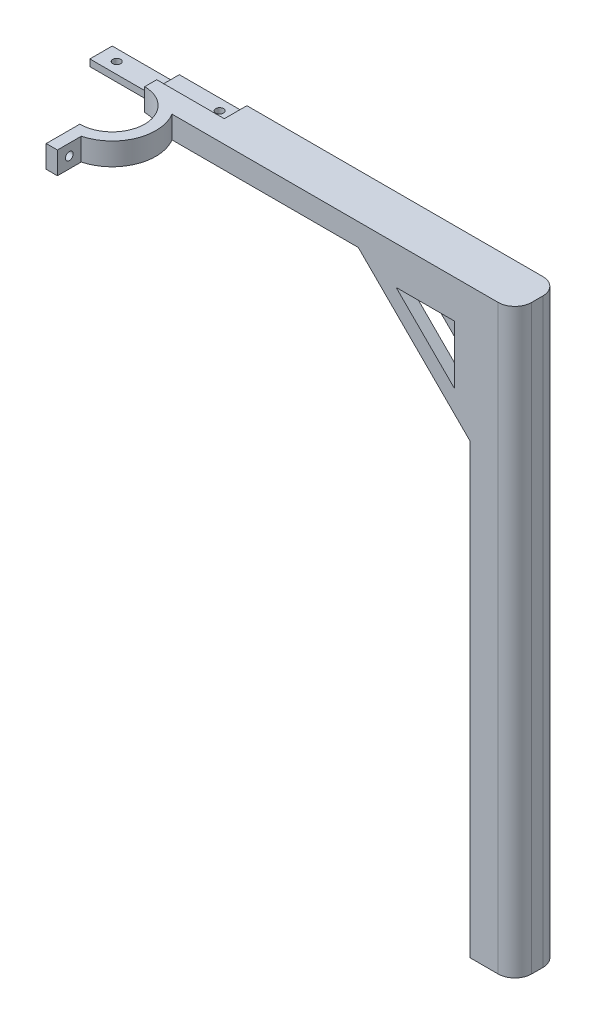
ISO-10303-21;
HEADER;
FILE_DESCRIPTION(('STEP AP214'),'2;1');
FILE_NAME('part.step','',(''),(''),'','','');
FILE_SCHEMA(('AUTOMOTIVE_DESIGN { 1 0 10303 214 1 1 1 1 }'));
ENDSEC;
DATA;
#1=APPLICATION_CONTEXT('core data for automotive mechanical design processes');
#2=APPLICATION_PROTOCOL_DEFINITION('international standard','automotive_design',2000,#1);
#3=PRODUCT_CONTEXT('',#1,'mechanical');
#4=PRODUCT('Part','Part','',(#3));
#5=PRODUCT_RELATED_PRODUCT_CATEGORY('part','',(#4));
#6=PRODUCT_DEFINITION_FORMATION('','',#4);
#7=PRODUCT_DEFINITION_CONTEXT('part definition',#1,'design');
#8=PRODUCT_DEFINITION('design','',#6,#7);
#9=PRODUCT_DEFINITION_SHAPE('','',#8);
#10=(LENGTH_UNIT() NAMED_UNIT(*) SI_UNIT(.MILLI.,.METRE.));
#11=(NAMED_UNIT(*) PLANE_ANGLE_UNIT() SI_UNIT($,.RADIAN.));
#12=(NAMED_UNIT(*) SI_UNIT($,.STERADIAN.) SOLID_ANGLE_UNIT());
#13=UNCERTAINTY_MEASURE_WITH_UNIT(LENGTH_MEASURE(1.E-05),#10,'distance_accuracy_value','');
#14=(GEOMETRIC_REPRESENTATION_CONTEXT(3) GLOBAL_UNCERTAINTY_ASSIGNED_CONTEXT((#13)) GLOBAL_UNIT_ASSIGNED_CONTEXT((#10,
#11,#12)) REPRESENTATION_CONTEXT('',''));
#15=CARTESIAN_POINT('',(0.,0.,0.));
#16=DIRECTION('',(0.,0.,1.));
#17=DIRECTION('',(1.,0.,0.));
#18=AXIS2_PLACEMENT_3D('',#15,#16,#17);
#19=CARTESIAN_POINT('',(340.,260.,0.));
#20=DIRECTION('',(0.,-1.,0.));
#21=DIRECTION('',(0.,0.,-1.));
#22=AXIS2_PLACEMENT_3D('',#19,#20,#21);
#23=PLANE('',#22);
#24=DIRECTION('',(-1.,0.,0.));
#25=VECTOR('',#24,1.);
#26=CARTESIAN_POINT('',(200.2,260.,-9.9));
#27=LINE('',#26,#25);
#28=CARTESIAN_POINT('',(200.2,260.,-9.9));
#29=VERTEX_POINT('',#28);
#30=CARTESIAN_POINT('',(170.,260.,-9.9));
#31=VERTEX_POINT('',#30);
#32=EDGE_CURVE('E327',#29,#31,#27,.T.);
#33=ORIENTED_EDGE('',*,*,#32,.T.);
#34=DIRECTION('',(0.,0.,1.));
#35=VECTOR('',#34,1.);
#36=CARTESIAN_POINT('',(170.,260.,0.));
#37=LINE('',#36,#35);
#38=CARTESIAN_POINT('',(170.,260.,-4.5));
#39=VERTEX_POINT('',#38);
#40=EDGE_CURVE('E478',#31,#39,#37,.T.);
#41=ORIENTED_EDGE('',*,*,#40,.T.);
#42=CARTESIAN_POINT('',(170.,260.,10.));
#43=DIRECTION('',(0.,-1.,0.));
#44=DIRECTION('',(0.,0.,1.));
#45=AXIS2_PLACEMENT_3D('',#42,#43,#44);
#46=CIRCLE('',#45,14.5);
#47=CARTESIAN_POINT('',(170.,260.,24.5));
#48=VERTEX_POINT('',#47);
#49=EDGE_CURVE('E458',#48,#39,#46,.F.);
#50=ORIENTED_EDGE('',*,*,#49,.F.);
#51=DIRECTION('',(0.,0.,1.));
#52=VECTOR('',#51,1.);
#53=CARTESIAN_POINT('',(170.,260.,0.));
#54=LINE('',#53,#52);
#55=CARTESIAN_POINT('',(170.,260.,39.5));
#56=VERTEX_POINT('',#55);
#57=EDGE_CURVE('E455',#48,#56,#54,.T.);
#58=ORIENTED_EDGE('',*,*,#57,.T.);
#59=DIRECTION('',(1.,0.,0.));
#60=VECTOR('',#59,1.);
#61=CARTESIAN_POINT('',(340.,260.,39.5));
#62=LINE('',#61,#60);
#63=CARTESIAN_POINT('',(175.,260.,39.5));
#64=VERTEX_POINT('',#63);
#65=EDGE_CURVE('E452',#56,#64,#62,.T.);
#66=ORIENTED_EDGE('',*,*,#65,.T.);
#67=DIRECTION('',(0.,0.,1.));
#68=VECTOR('',#67,1.);
#69=CARTESIAN_POINT('',(175.,260.,0.));
#70=LINE('',#69,#68);
#71=CARTESIAN_POINT('',(175.,260.,28.8480768249708));
#72=VERTEX_POINT('',#71);
#73=EDGE_CURVE('E449',#72,#64,#70,.T.);
#74=ORIENTED_EDGE('',*,*,#73,.F.);
#75=CARTESIAN_POINT('',(170.,260.,10.));
#76=DIRECTION('',(0.,-1.,0.));
#77=DIRECTION('',(0.,0.,1.));
#78=AXIS2_PLACEMENT_3D('',#75,#76,#77);
#79=CIRCLE('',#78,19.5);
#80=CARTESIAN_POINT('',(186.740669042783,260.,0.));
#81=VERTEX_POINT('',#80);
#82=EDGE_CURVE('E430',#72,#81,#79,.F.);
#83=ORIENTED_EDGE('',*,*,#82,.T.);
#84=DIRECTION('',(-1.,0.,0.));
#85=VECTOR('',#84,1.);
#86=CARTESIAN_POINT('',(340.,260.,0.));
#87=LINE('',#86,#85);
#88=CARTESIAN_POINT('',(332.5,260.,0.));
#89=VERTEX_POINT('',#88);
#90=EDGE_CURVE('E490',#89,#81,#87,.T.);
#91=ORIENTED_EDGE('',*,*,#90,.F.);
#92=CARTESIAN_POINT('',(332.5,260.,-7.5));
#93=DIRECTION('',(0.,1.,0.));
#94=DIRECTION('',(0.,0.,-1.));
#95=AXIS2_PLACEMENT_3D('',#92,#93,#94);
#96=CIRCLE('',#95,7.5);
#97=CARTESIAN_POINT('',(340.,260.,-7.5));
#98=VERTEX_POINT('',#97);
#99=EDGE_CURVE('E85',#98,#89,#96,.F.);
#100=ORIENTED_EDGE('',*,*,#99,.F.);
#101=DIRECTION('',(0.,0.,1.));
#102=VECTOR('',#101,1.);
#103=CARTESIAN_POINT('',(340.,260.,0.));
#104=LINE('',#103,#102);
#105=CARTESIAN_POINT('',(340.,260.,-12.5));
#106=VERTEX_POINT('',#105);
#107=EDGE_CURVE('E487',#106,#98,#104,.T.);
#108=ORIENTED_EDGE('',*,*,#107,.F.);
#109=CARTESIAN_POINT('',(332.5,260.,-12.5));
#110=DIRECTION('',(0.,1.,0.));
#111=DIRECTION('',(0.,0.,-1.));
#112=AXIS2_PLACEMENT_3D('',#109,#110,#111);
#113=CIRCLE('',#112,7.5);
#114=CARTESIAN_POINT('',(332.5,260.,-20.));
#115=VERTEX_POINT('',#114);
#116=EDGE_CURVE('E524',#115,#106,#113,.F.);
#117=ORIENTED_EDGE('',*,*,#116,.F.);
#118=DIRECTION('',(1.,0.,0.));
#119=VECTOR('',#118,1.);
#120=CARTESIAN_POINT('',(340.,260.,-20.));
#121=LINE('',#120,#119);
#122=CARTESIAN_POINT('',(200.2,260.,-20.));
#123=VERTEX_POINT('',#122);
#124=EDGE_CURVE('E99',#123,#115,#121,.T.);
#125=ORIENTED_EDGE('',*,*,#124,.F.);
#126=DIRECTION('',(0.,0.,1.));
#127=VECTOR('',#126,1.);
#128=CARTESIAN_POINT('',(200.2,260.,-20.));
#129=LINE('',#128,#127);
#130=EDGE_CURVE('E92',#123,#29,#129,.T.);
#131=ORIENTED_EDGE('',*,*,#130,.T.);
#132=EDGE_LOOP('',(#33,#41,#50,#58,#66,#74,#83,#91,#100,#108,#117,#125,#131));
#133=FACE_BOUND('',#132,.T.);
#134=ADVANCED_FACE('F76',(#133),#23,.F.);
#135=CARTESIAN_POINT('',(170.,0.,0.));
#136=DIRECTION('',(-1.,0.,0.));
#137=DIRECTION('',(0.,0.,-1.));
#138=AXIS2_PLACEMENT_3D('',#135,#136,#137);
#139=PLANE('',#138);
#140=DIRECTION('',(0.,-1.,0.));
#141=VECTOR('',#140,1.);
#142=CARTESIAN_POINT('',(170.,250.,-10.));
#143=LINE('',#142,#141);
#144=CARTESIAN_POINT('',(170.,253.,-10.));
#145=VERTEX_POINT('',#144);
#146=CARTESIAN_POINT('',(170.,250.,-10.));
#147=VERTEX_POINT('',#146);
#148=EDGE_CURVE('E295',#145,#147,#143,.T.);
#149=ORIENTED_EDGE('',*,*,#148,.T.);
#150=DIRECTION('',(0.,0.,-1.));
#151=VECTOR('',#150,1.);
#152=CARTESIAN_POINT('',(170.,250.,0.));
#153=LINE('',#152,#151);
#154=CARTESIAN_POINT('',(170.,250.,-4.5));
#155=VERTEX_POINT('',#154);
#156=EDGE_CURVE('E473',#155,#147,#153,.T.);
#157=ORIENTED_EDGE('',*,*,#156,.F.);
#158=DIRECTION('',(0.,1.,0.));
#159=VECTOR('',#158,1.);
#160=CARTESIAN_POINT('',(170.,0.,-4.5));
#161=LINE('',#160,#159);
#162=EDGE_CURVE('E510',#39,#155,#161,.F.);
#163=ORIENTED_EDGE('',*,*,#162,.F.);
#164=ORIENTED_EDGE('',*,*,#40,.F.);
#165=DIRECTION('',(0.,-1.,0.));
#166=VECTOR('',#165,1.);
#167=CARTESIAN_POINT('',(170.,260.,-9.9));
#168=LINE('',#167,#166);
#169=CARTESIAN_POINT('',(170.,256.9,-9.9));
#170=VERTEX_POINT('',#169);
#171=EDGE_CURVE('E308',#31,#170,#168,.T.);
#172=ORIENTED_EDGE('',*,*,#171,.T.);
#173=DIRECTION('',(0.,0.,-1.));
#174=VECTOR('',#173,1.);
#175=CARTESIAN_POINT('',(170.,256.9,-20.));
#176=LINE('',#175,#174);
#177=CARTESIAN_POINT('',(170.,256.9,-20.));
#178=VERTEX_POINT('',#177);
#179=EDGE_CURVE('E312',#170,#178,#176,.T.);
#180=ORIENTED_EDGE('',*,*,#179,.T.);
#181=DIRECTION('',(0.,1.,0.));
#182=VECTOR('',#181,1.);
#183=CARTESIAN_POINT('',(170.,260.,-20.));
#184=LINE('',#183,#182);
#185=CARTESIAN_POINT('',(170.,253.,-20.));
#186=VERTEX_POINT('',#185);
#187=EDGE_CURVE('E476',#186,#178,#184,.T.);
#188=ORIENTED_EDGE('',*,*,#187,.F.);
#189=DIRECTION('',(0.,0.,1.));
#190=VECTOR('',#189,1.);
#191=CARTESIAN_POINT('',(170.,253.,-20.));
#192=LINE('',#191,#190);
#193=EDGE_CURVE('E275',#186,#145,#192,.T.);
#194=ORIENTED_EDGE('',*,*,#193,.T.);
#195=EDGE_LOOP('',(#149,#157,#163,#164,#172,#180,#188,#194));
#196=FACE_BOUND('',#195,.T.);
#197=ADVANCED_FACE('F568',(#196),#139,.T.);
#198=CARTESIAN_POINT('',(340.,260.,-20.));
#199=DIRECTION('',(0.,0.,1.));
#200=DIRECTION('',(-1.,0.,0.));
#201=AXIS2_PLACEMENT_3D('',#198,#199,#200);
#202=PLANE('',#201);
#203=DIRECTION('',(-1.,0.,0.));
#204=VECTOR('',#203,1.);
#205=CARTESIAN_POINT('',(340.,243.,-20.));
#206=LINE('',#205,#204);
#207=CARTESIAN_POINT('',(313.,243.,-20.));
#208=VERTEX_POINT('',#207);
#209=CARTESIAN_POINT('',(286.899494936612,243.,-20.));
#210=VERTEX_POINT('',#209);
#211=EDGE_CURVE('E346',#208,#210,#206,.T.);
#212=ORIENTED_EDGE('',*,*,#211,.T.);
#213=DIRECTION('',(0.707106781186548,-0.707106781186547,0.));
#214=VECTOR('',#213,1.);
#215=CARTESIAN_POINT('',(434.949747468306,94.9497474683059,-20.));
#216=LINE('',#215,#214);
#217=CARTESIAN_POINT('',(313.,216.899494936612,-20.));
#218=VERTEX_POINT('',#217);
#219=EDGE_CURVE('E362',#210,#218,#216,.T.);
#220=ORIENTED_EDGE('',*,*,#219,.T.);
#221=DIRECTION('',(0.,1.,0.));
#222=VECTOR('',#221,1.);
#223=CARTESIAN_POINT('',(313.,0.,-20.));
#224=LINE('',#223,#222);
#225=EDGE_CURVE('E353',#218,#208,#224,.T.);
#226=ORIENTED_EDGE('',*,*,#225,.T.);
#227=EDGE_LOOP('',(#212,#220,#226));
#228=FACE_BOUND('',#227,.T.);
#229=DIRECTION('',(-1.,0.,0.));
#230=VECTOR('',#229,1.);
#231=CARTESIAN_POINT('',(200.2,256.9,-20.));
#232=LINE('',#231,#230);
#233=CARTESIAN_POINT('',(200.2,256.9,-20.));
#234=VERTEX_POINT('',#233);
#235=EDGE_CURVE('E318',#234,#178,#232,.T.);
#236=ORIENTED_EDGE('',*,*,#235,.F.);
#237=DIRECTION('',(0.,1.,0.));
#238=VECTOR('',#237,1.);
#239=CARTESIAN_POINT('',(200.2,260.,-20.));
#240=LINE('',#239,#238);
#241=EDGE_CURVE('E310',#234,#123,#240,.T.);
#242=ORIENTED_EDGE('',*,*,#241,.T.);
#243=ORIENTED_EDGE('',*,*,#124,.T.);
#244=DIRECTION('',(0.,-1.,0.));
#245=VECTOR('',#244,1.);
#246=CARTESIAN_POINT('',(332.5,260.,-20.));
#247=LINE('',#246,#245);
#248=CARTESIAN_POINT('',(332.5,0.,-20.));
#249=VERTEX_POINT('',#248);
#250=EDGE_CURVE('E12',#249,#115,#247,.F.);
#251=ORIENTED_EDGE('',*,*,#250,.F.);
#252=DIRECTION('',(1.,0.,0.));
#253=VECTOR('',#252,1.);
#254=CARTESIAN_POINT('',(340.,0.,-20.));
#255=LINE('',#254,#253);
#256=CARTESIAN_POINT('',(320.,0.,-20.));
#257=VERTEX_POINT('',#256);
#258=EDGE_CURVE('E491',#257,#249,#255,.T.);
#259=ORIENTED_EDGE('',*,*,#258,.F.);
#260=DIRECTION('',(0.,-1.,0.));
#261=VECTOR('',#260,1.);
#262=CARTESIAN_POINT('',(320.,260.,-20.));
#263=LINE('',#262,#261);
#264=CARTESIAN_POINT('',(320.,200.,-20.));
#265=VERTEX_POINT('',#264);
#266=EDGE_CURVE('E495',#265,#257,#263,.T.);
#267=ORIENTED_EDGE('',*,*,#266,.F.);
#268=DIRECTION('',(0.707106781186548,-0.707106781186547,0.));
#269=VECTOR('',#268,1.);
#270=CARTESIAN_POINT('',(270.,250.,-20.));
#271=LINE('',#270,#269);
#272=CARTESIAN_POINT('',(270.,250.,-20.));
#273=VERTEX_POINT('',#272);
#274=EDGE_CURVE('E369',#273,#265,#271,.T.);
#275=ORIENTED_EDGE('',*,*,#274,.F.);
#276=DIRECTION('',(1.,0.,0.));
#277=VECTOR('',#276,1.);
#278=CARTESIAN_POINT('',(170.,250.,-20.));
#279=LINE('',#278,#277);
#280=CARTESIAN_POINT('',(140.,250.,-20.));
#281=VERTEX_POINT('',#280);
#282=EDGE_CURVE('E294',#281,#273,#279,.T.);
#283=ORIENTED_EDGE('',*,*,#282,.F.);
#284=DIRECTION('',(0.,1.,0.));
#285=VECTOR('',#284,1.);
#286=CARTESIAN_POINT('',(140.,250.,-20.));
#287=LINE('',#286,#285);
#288=CARTESIAN_POINT('',(140.,253.,-20.));
#289=VERTEX_POINT('',#288);
#290=EDGE_CURVE('E286',#281,#289,#287,.T.);
#291=ORIENTED_EDGE('',*,*,#290,.T.);
#292=DIRECTION('',(1.,0.,0.));
#293=VECTOR('',#292,1.);
#294=CARTESIAN_POINT('',(140.,253.,-20.));
#295=LINE('',#294,#293);
#296=EDGE_CURVE('E270',#289,#186,#295,.T.);
#297=ORIENTED_EDGE('',*,*,#296,.T.);
#298=ORIENTED_EDGE('',*,*,#187,.T.);
#299=EDGE_LOOP('',(#236,#242,#243,#251,#259,#267,#275,#283,#291,#297,#298));
#300=FACE_BOUND('',#299,.T.);
#301=ADVANCED_FACE('F292',(#228,#300),#202,.F.);
#302=CARTESIAN_POINT('',(170.,250.,0.));
#303=DIRECTION('',(0.,1.,0.));
#304=DIRECTION('',(0.,0.,1.));
#305=AXIS2_PLACEMENT_3D('',#302,#303,#304);
#306=PLANE('',#305);
#307=CARTESIAN_POINT('',(147.,250.,-15.));
#308=DIRECTION('',(0.,1.,0.));
#309=DIRECTION('',(0.,0.,1.));
#310=AXIS2_PLACEMENT_3D('',#307,#308,#309);
#311=CIRCLE('',#310,1.75000000000001);
#312=CARTESIAN_POINT('',(147.,250.,-13.25));
#313=VERTEX_POINT('',#312);
#314=EDGE_CURVE('E867',#313,#313,#311,.F.);
#315=ORIENTED_EDGE('',*,*,#314,.F.);
#316=EDGE_LOOP('',(#315));
#317=FACE_BOUND('',#316,.T.);
#318=CARTESIAN_POINT('',(193.,250.,-15.));
#319=DIRECTION('',(0.,1.,0.));
#320=DIRECTION('',(0.,0.,1.));
#321=AXIS2_PLACEMENT_3D('',#318,#319,#320);
#322=CIRCLE('',#321,1.75000000000001);
#323=CARTESIAN_POINT('',(193.,250.,-13.25));
#324=VERTEX_POINT('',#323);
#325=EDGE_CURVE('E300',#324,#324,#322,.T.);
#326=ORIENTED_EDGE('',*,*,#325,.T.);
#327=EDGE_LOOP('',(#326));
#328=FACE_BOUND('',#327,.T.);
#329=DIRECTION('',(-1.,0.,0.));
#330=VECTOR('',#329,1.);
#331=CARTESIAN_POINT('',(320.,250.,-15.));
#332=LINE('',#331,#330);
#333=CARTESIAN_POINT('',(320.,250.,-15.));
#334=VERTEX_POINT('',#333);
#335=CARTESIAN_POINT('',(270.,250.,-15.));
#336=VERTEX_POINT('',#335);
#337=EDGE_CURVE('E373',#334,#336,#332,.T.);
#338=ORIENTED_EDGE('',*,*,#337,.F.);
#339=DIRECTION('',(0.,0.,-1.));
#340=VECTOR('',#339,1.);
#341=CARTESIAN_POINT('',(320.,250.,0.));
#342=LINE('',#341,#340);
#343=CARTESIAN_POINT('',(320.,250.,-5.));
#344=VERTEX_POINT('',#343);
#345=EDGE_CURVE('E472',#344,#334,#342,.T.);
#346=ORIENTED_EDGE('',*,*,#345,.F.);
#347=DIRECTION('',(-1.,0.,0.));
#348=VECTOR('',#347,1.);
#349=CARTESIAN_POINT('',(320.,250.,-5.));
#350=LINE('',#349,#348);
#351=CARTESIAN_POINT('',(270.,250.,-5.));
#352=VERTEX_POINT('',#351);
#353=EDGE_CURVE('E412',#344,#352,#350,.T.);
#354=ORIENTED_EDGE('',*,*,#353,.T.);
#355=DIRECTION('',(0.,0.,1.));
#356=VECTOR('',#355,1.);
#357=CARTESIAN_POINT('',(270.,250.,-5.));
#358=LINE('',#357,#356);
#359=CARTESIAN_POINT('',(270.,250.,0.));
#360=VERTEX_POINT('',#359);
#361=EDGE_CURVE('E423',#352,#360,#358,.T.);
#362=ORIENTED_EDGE('',*,*,#361,.T.);
#363=DIRECTION('',(1.,0.,0.));
#364=VECTOR('',#363,1.);
#365=CARTESIAN_POINT('',(170.,250.,0.));
#366=LINE('',#365,#364);
#367=CARTESIAN_POINT('',(186.740669042783,250.,0.));
#368=VERTEX_POINT('',#367);
#369=EDGE_CURVE('E483',#368,#360,#366,.T.);
#370=ORIENTED_EDGE('',*,*,#369,.F.);
#371=CARTESIAN_POINT('',(170.,250.,10.));
#372=DIRECTION('',(0.,-1.,0.));
#373=DIRECTION('',(0.,0.,1.));
#374=AXIS2_PLACEMENT_3D('',#371,#372,#373);
#375=CIRCLE('',#374,19.5);
#376=CARTESIAN_POINT('',(175.,250.,28.8480768249708));
#377=VERTEX_POINT('',#376);
#378=EDGE_CURVE('E443',#368,#377,#375,.T.);
#379=ORIENTED_EDGE('',*,*,#378,.T.);
#380=DIRECTION('',(0.,0.,-1.));
#381=VECTOR('',#380,1.);
#382=CARTESIAN_POINT('',(175.,250.,0.));
#383=LINE('',#382,#381);
#384=CARTESIAN_POINT('',(175.,250.,39.5));
#385=VERTEX_POINT('',#384);
#386=EDGE_CURVE('E446',#385,#377,#383,.T.);
#387=ORIENTED_EDGE('',*,*,#386,.F.);
#388=DIRECTION('',(-1.,0.,0.));
#389=VECTOR('',#388,1.);
#390=CARTESIAN_POINT('',(340.,250.,39.5));
#391=LINE('',#390,#389);
#392=CARTESIAN_POINT('',(170.,250.,39.5));
#393=VERTEX_POINT('',#392);
#394=EDGE_CURVE('E433',#385,#393,#391,.T.);
#395=ORIENTED_EDGE('',*,*,#394,.T.);
#396=DIRECTION('',(0.,0.,-1.));
#397=VECTOR('',#396,1.);
#398=CARTESIAN_POINT('',(170.,250.,0.));
#399=LINE('',#398,#397);
#400=CARTESIAN_POINT('',(170.,250.,24.5));
#401=VERTEX_POINT('',#400);
#402=EDGE_CURVE('E436',#393,#401,#399,.T.);
#403=ORIENTED_EDGE('',*,*,#402,.T.);
#404=CARTESIAN_POINT('',(170.,250.,10.));
#405=DIRECTION('',(0.,-1.,0.));
#406=DIRECTION('',(0.,0.,1.));
#407=AXIS2_PLACEMENT_3D('',#404,#405,#406);
#408=CIRCLE('',#407,14.5);
#409=EDGE_CURVE('E440',#155,#401,#408,.T.);
#410=ORIENTED_EDGE('',*,*,#409,.F.);
#411=ORIENTED_EDGE('',*,*,#156,.T.);
#412=DIRECTION('',(1.,0.,0.));
#413=VECTOR('',#412,1.);
#414=CARTESIAN_POINT('',(140.,250.,-10.));
#415=LINE('',#414,#413);
#416=CARTESIAN_POINT('',(140.,250.,-10.));
#417=VERTEX_POINT('',#416);
#418=EDGE_CURVE('E306',#417,#147,#415,.T.);
#419=ORIENTED_EDGE('',*,*,#418,.F.);
#420=DIRECTION('',(0.,0.,-1.));
#421=VECTOR('',#420,1.);
#422=CARTESIAN_POINT('',(140.,250.,-20.));
#423=LINE('',#422,#421);
#424=EDGE_CURVE('E279',#417,#281,#423,.T.);
#425=ORIENTED_EDGE('',*,*,#424,.T.);
#426=ORIENTED_EDGE('',*,*,#282,.T.);
#427=DIRECTION('',(0.,0.,-1.));
#428=VECTOR('',#427,1.);
#429=CARTESIAN_POINT('',(270.,250.,-15.));
#430=LINE('',#429,#428);
#431=EDGE_CURVE('E380',#336,#273,#430,.T.);
#432=ORIENTED_EDGE('',*,*,#431,.F.);
#433=EDGE_LOOP('',(#338,#346,#354,#362,#370,#379,#387,#395,#403,#410,#411,#419,#425,#426,#432));
#434=FACE_BOUND('',#433,.T.);
#435=ADVANCED_FACE('F561',(#317,#328,#434),#306,.F.);
#436=CARTESIAN_POINT('',(320.,260.,0.));
#437=DIRECTION('',(1.,0.,0.));
#438=DIRECTION('',(0.,0.,1.));
#439=AXIS2_PLACEMENT_3D('',#436,#437,#438);
#440=PLANE('',#439);
#441=ORIENTED_EDGE('',*,*,#266,.T.);
#442=DIRECTION('',(0.,0.,-1.));
#443=VECTOR('',#442,1.);
#444=CARTESIAN_POINT('',(320.,0.,0.));
#445=LINE('',#444,#443);
#446=CARTESIAN_POINT('',(320.,0.,0.));
#447=VERTEX_POINT('',#446);
#448=EDGE_CURVE('E500',#447,#257,#445,.T.);
#449=ORIENTED_EDGE('',*,*,#448,.F.);
#450=DIRECTION('',(0.,-1.,0.));
#451=VECTOR('',#450,1.);
#452=CARTESIAN_POINT('',(320.,260.,0.));
#453=LINE('',#452,#451);
#454=CARTESIAN_POINT('',(320.,200.,0.));
#455=VERTEX_POINT('',#454);
#456=EDGE_CURVE('E507',#455,#447,#453,.T.);
#457=ORIENTED_EDGE('',*,*,#456,.F.);
#458=DIRECTION('',(0.,0.,1.));
#459=VECTOR('',#458,1.);
#460=CARTESIAN_POINT('',(320.,200.,-5.));
#461=LINE('',#460,#459);
#462=CARTESIAN_POINT('',(320.,200.,-5.));
#463=VERTEX_POINT('',#462);
#464=EDGE_CURVE('E419',#463,#455,#461,.T.);
#465=ORIENTED_EDGE('',*,*,#464,.F.);
#466=DIRECTION('',(0.,1.,0.));
#467=VECTOR('',#466,1.);
#468=CARTESIAN_POINT('',(320.,200.,-5.));
#469=LINE('',#468,#467);
#470=EDGE_CURVE('E417',#463,#344,#469,.T.);
#471=ORIENTED_EDGE('',*,*,#470,.T.);
#472=ORIENTED_EDGE('',*,*,#345,.T.);
#473=DIRECTION('',(0.,1.,0.));
#474=VECTOR('',#473,1.);
#475=CARTESIAN_POINT('',(320.,200.,-15.));
#476=LINE('',#475,#474);
#477=CARTESIAN_POINT('',(320.,200.,-15.));
#478=VERTEX_POINT('',#477);
#479=EDGE_CURVE('E376',#478,#334,#476,.T.);
#480=ORIENTED_EDGE('',*,*,#479,.F.);
#481=DIRECTION('',(0.,0.,-1.));
#482=VECTOR('',#481,1.);
#483=CARTESIAN_POINT('',(320.,200.,-15.));
#484=LINE('',#483,#482);
#485=EDGE_CURVE('E384',#478,#265,#484,.T.);
#486=ORIENTED_EDGE('',*,*,#485,.T.);
#487=EDGE_LOOP('',(#441,#449,#457,#465,#471,#472,#480,#486));
#488=FACE_BOUND('',#487,.T.);
#489=ADVANCED_FACE('F553',(#488),#440,.F.);
#490=CARTESIAN_POINT('',(340.,260.,0.));
#491=DIRECTION('',(-1.,0.,0.));
#492=DIRECTION('',(0.,0.,-1.));
#493=AXIS2_PLACEMENT_3D('',#490,#491,#492);
#494=PLANE('',#493);
#495=DIRECTION('',(0.,0.,1.));
#496=VECTOR('',#495,1.);
#497=CARTESIAN_POINT('',(340.,0.,0.));
#498=LINE('',#497,#496);
#499=CARTESIAN_POINT('',(340.,0.,-12.5));
#500=VERTEX_POINT('',#499);
#501=CARTESIAN_POINT('',(340.,0.,-7.5));
#502=VERTEX_POINT('',#501);
#503=EDGE_CURVE('E486',#500,#502,#498,.T.);
#504=ORIENTED_EDGE('',*,*,#503,.F.);
#505=DIRECTION('',(0.,-1.,0.));
#506=VECTOR('',#505,1.);
#507=CARTESIAN_POINT('',(340.,260.,-12.5));
#508=LINE('',#507,#506);
#509=EDGE_CURVE('E519',#106,#500,#508,.T.);
#510=ORIENTED_EDGE('',*,*,#509,.F.);
#511=ORIENTED_EDGE('',*,*,#107,.T.);
#512=DIRECTION('',(0.,-1.,0.));
#513=VECTOR('',#512,1.);
#514=CARTESIAN_POINT('',(340.,260.,-7.5));
#515=LINE('',#514,#513);
#516=EDGE_CURVE('E522',#502,#98,#515,.F.);
#517=ORIENTED_EDGE('',*,*,#516,.F.);
#518=EDGE_LOOP('',(#504,#510,#511,#517));
#519=FACE_BOUND('',#518,.T.);
#520=ADVANCED_FACE('F548',(#519),#494,.F.);
#521=CARTESIAN_POINT('',(340.,260.,0.));
#522=DIRECTION('',(0.,0.,-1.));
#523=DIRECTION('',(1.,0.,0.));
#524=AXIS2_PLACEMENT_3D('',#521,#522,#523);
#525=PLANE('',#524);
#526=ORIENTED_EDGE('',*,*,#90,.T.);
#527=DIRECTION('',(0.,1.,0.));
#528=VECTOR('',#527,1.);
#529=CARTESIAN_POINT('',(186.740669042783,205.948893316966,0.));
#530=LINE('',#529,#528);
#531=EDGE_CURVE('E437',#368,#81,#530,.T.);
#532=ORIENTED_EDGE('',*,*,#531,.F.);
#533=ORIENTED_EDGE('',*,*,#369,.T.);
#534=DIRECTION('',(0.707106781186548,-0.707106781186547,0.));
#535=VECTOR('',#534,1.);
#536=CARTESIAN_POINT('',(270.,250.,0.));
#537=LINE('',#536,#535);
#538=EDGE_CURVE('E408',#360,#455,#537,.T.);
#539=ORIENTED_EDGE('',*,*,#538,.T.);
#540=ORIENTED_EDGE('',*,*,#456,.T.);
#541=DIRECTION('',(-1.,0.,0.));
#542=VECTOR('',#541,1.);
#543=CARTESIAN_POINT('',(340.,0.,0.));
#544=LINE('',#543,#542);
#545=CARTESIAN_POINT('',(332.5,0.,0.));
#546=VERTEX_POINT('',#545);
#547=EDGE_CURVE('E498',#546,#447,#544,.T.);
#548=ORIENTED_EDGE('',*,*,#547,.F.);
#549=DIRECTION('',(0.,-1.,0.));
#550=VECTOR('',#549,1.);
#551=CARTESIAN_POINT('',(332.5,260.,0.));
#552=LINE('',#551,#550);
#553=EDGE_CURVE('E512',#89,#546,#552,.T.);
#554=ORIENTED_EDGE('',*,*,#553,.F.);
#555=EDGE_LOOP('',(#526,#532,#533,#539,#540,#548,#554));
#556=FACE_BOUND('',#555,.T.);
#557=DIRECTION('',(0.,1.,0.));
#558=VECTOR('',#557,1.);
#559=CARTESIAN_POINT('',(313.,0.,0.));
#560=LINE('',#559,#558);
#561=CARTESIAN_POINT('',(313.,216.899494936612,0.));
#562=VERTEX_POINT('',#561);
#563=CARTESIAN_POINT('',(313.,243.,0.));
#564=VERTEX_POINT('',#563);
#565=EDGE_CURVE('E401',#562,#564,#560,.T.);
#566=ORIENTED_EDGE('',*,*,#565,.F.);
#567=DIRECTION('',(0.707106781186548,-0.707106781186547,0.));
#568=VECTOR('',#567,1.);
#569=CARTESIAN_POINT('',(434.949747468306,94.9497474683059,0.));
#570=LINE('',#569,#568);
#571=CARTESIAN_POINT('',(286.899494936612,243.,0.));
#572=VERTEX_POINT('',#571);
#573=EDGE_CURVE('E392',#572,#562,#570,.T.);
#574=ORIENTED_EDGE('',*,*,#573,.F.);
#575=DIRECTION('',(-1.,0.,0.));
#576=VECTOR('',#575,1.);
#577=CARTESIAN_POINT('',(340.,243.,0.));
#578=LINE('',#577,#576);
#579=EDGE_CURVE('E387',#564,#572,#578,.T.);
#580=ORIENTED_EDGE('',*,*,#579,.F.);
#581=EDGE_LOOP('',(#566,#574,#580));
#582=FACE_BOUND('',#581,.T.);
#583=ADVANCED_FACE('F539',(#556,#582),#525,.F.);
#584=CARTESIAN_POINT('',(340.,0.,0.));
#585=DIRECTION('',(0.,-1.,0.));
#586=DIRECTION('',(0.,0.,-1.));
#587=AXIS2_PLACEMENT_3D('',#584,#585,#586);
#588=PLANE('',#587);
#589=CARTESIAN_POINT('',(325.,0.,-15.));
#590=DIRECTION('',(0.,1.,0.));
#591=DIRECTION('',(0.,0.,-1.));
#592=AXIS2_PLACEMENT_3D('',#589,#590,#591);
#593=CIRCLE('',#592,2.5);
#594=CARTESIAN_POINT('',(325.,0.,-17.5));
#595=VERTEX_POINT('',#594);
#596=EDGE_CURVE('E338',#595,#595,#593,.T.);
#597=ORIENTED_EDGE('',*,*,#596,.T.);
#598=EDGE_LOOP('',(#597));
#599=FACE_BOUND('',#598,.T.);
#600=CARTESIAN_POINT('',(335.,0.,-10.));
#601=DIRECTION('',(0.,1.,0.));
#602=DIRECTION('',(0.,0.,-1.));
#603=AXIS2_PLACEMENT_3D('',#600,#601,#602);
#604=CIRCLE('',#603,2.5);
#605=CARTESIAN_POINT('',(335.,0.,-12.5));
#606=VERTEX_POINT('',#605);
#607=EDGE_CURVE('E331',#606,#606,#604,.T.);
#608=ORIENTED_EDGE('',*,*,#607,.T.);
#609=EDGE_LOOP('',(#608));
#610=FACE_BOUND('',#609,.T.);
#611=CARTESIAN_POINT('',(325.,0.,-5.));
#612=DIRECTION('',(0.,1.,0.));
#613=DIRECTION('',(0.,0.,-1.));
#614=AXIS2_PLACEMENT_3D('',#611,#612,#613);
#615=CIRCLE('',#614,2.5);
#616=CARTESIAN_POINT('',(325.,0.,-7.5));
#617=VERTEX_POINT('',#616);
#618=EDGE_CURVE('E334',#617,#617,#615,.T.);
#619=ORIENTED_EDGE('',*,*,#618,.T.);
#620=EDGE_LOOP('',(#619));
#621=FACE_BOUND('',#620,.T.);
#622=ORIENTED_EDGE('',*,*,#547,.T.);
#623=ORIENTED_EDGE('',*,*,#448,.T.);
#624=ORIENTED_EDGE('',*,*,#258,.T.);
#625=CARTESIAN_POINT('',(332.5,0.,-12.5));
#626=DIRECTION('',(0.,1.,0.));
#627=DIRECTION('',(0.,0.,-1.));
#628=AXIS2_PLACEMENT_3D('',#625,#626,#627);
#629=CIRCLE('',#628,7.5);
#630=EDGE_CURVE('E515',#500,#249,#629,.T.);
#631=ORIENTED_EDGE('',*,*,#630,.F.);
#632=ORIENTED_EDGE('',*,*,#503,.T.);
#633=CARTESIAN_POINT('',(332.5,0.,-7.5));
#634=DIRECTION('',(0.,1.,0.));
#635=DIRECTION('',(0.,0.,-1.));
#636=AXIS2_PLACEMENT_3D('',#633,#634,#635);
#637=CIRCLE('',#636,7.5);
#638=EDGE_CURVE('E517',#546,#502,#637,.T.);
#639=ORIENTED_EDGE('',*,*,#638,.F.);
#640=EDGE_LOOP('',(#622,#623,#624,#631,#632,#639));
#641=FACE_BOUND('',#640,.T.);
#642=ADVANCED_FACE('F545',(#599,#610,#621,#641),#588,.T.);
#643=CARTESIAN_POINT('',(170.,205.948893316966,10.));
#644=DIRECTION('',(0.,1.,0.));
#645=DIRECTION('',(0.,0.,1.));
#646=AXIS2_PLACEMENT_3D('',#643,#644,#645);
#647=CYLINDRICAL_SURFACE('',#646,19.5);
#648=ORIENTED_EDGE('',*,*,#531,.T.);
#649=ORIENTED_EDGE('',*,*,#82,.F.);
#650=DIRECTION('',(0.,1.,0.));
#651=VECTOR('',#650,1.);
#652=CARTESIAN_POINT('',(175.,205.948893316966,28.8480768249708));
#653=LINE('',#652,#651);
#654=EDGE_CURVE('E461',#377,#72,#653,.T.);
#655=ORIENTED_EDGE('',*,*,#654,.F.);
#656=ORIENTED_EDGE('',*,*,#378,.F.);
#657=EDGE_LOOP('',(#648,#649,#655,#656));
#658=FACE_BOUND('',#657,.T.);
#659=ADVANCED_FACE('F596',(#658),#647,.T.);
#660=CARTESIAN_POINT('',(170.,205.948893316966,10.));
#661=DIRECTION('',(0.,1.,0.));
#662=DIRECTION('',(0.,0.,1.));
#663=AXIS2_PLACEMENT_3D('',#660,#661,#662);
#664=CYLINDRICAL_SURFACE('',#663,14.5);
#665=ORIENTED_EDGE('',*,*,#409,.T.);
#666=DIRECTION('',(0.,1.,0.));
#667=VECTOR('',#666,1.);
#668=CARTESIAN_POINT('',(170.,205.948893316966,24.5));
#669=LINE('',#668,#667);
#670=EDGE_CURVE('E463',#401,#48,#669,.T.);
#671=ORIENTED_EDGE('',*,*,#670,.T.);
#672=ORIENTED_EDGE('',*,*,#49,.T.);
#673=ORIENTED_EDGE('',*,*,#162,.T.);
#674=EDGE_LOOP('',(#665,#671,#672,#673));
#675=FACE_BOUND('',#674,.T.);
#676=ADVANCED_FACE('F659',(#675),#664,.F.);
#677=CARTESIAN_POINT('',(170.,205.948893316966,0.));
#678=DIRECTION('',(1.,0.,0.));
#679=DIRECTION('',(0.,0.,1.));
#680=AXIS2_PLACEMENT_3D('',#677,#678,#679);
#681=PLANE('',#680);
#682=CARTESIAN_POINT('',(170.,255.,34.1740384124854));
#683=DIRECTION('',(-1.,0.,0.));
#684=DIRECTION('',(0.,0.,1.));
#685=AXIS2_PLACEMENT_3D('',#682,#683,#684);
#686=CIRCLE('',#685,1.75);
#687=CARTESIAN_POINT('',(170.,255.,35.9240384124854));
#688=VERTEX_POINT('',#687);
#689=EDGE_CURVE('E427',#688,#688,#686,.T.);
#690=ORIENTED_EDGE('',*,*,#689,.F.);
#691=EDGE_LOOP('',(#690));
#692=FACE_BOUND('',#691,.T.);
#693=DIRECTION('',(0.,1.,0.));
#694=VECTOR('',#693,1.);
#695=CARTESIAN_POINT('',(170.,205.948893316966,39.5));
#696=LINE('',#695,#694);
#697=EDGE_CURVE('E465',#393,#56,#696,.T.);
#698=ORIENTED_EDGE('',*,*,#697,.T.);
#699=ORIENTED_EDGE('',*,*,#57,.F.);
#700=ORIENTED_EDGE('',*,*,#670,.F.);
#701=ORIENTED_EDGE('',*,*,#402,.F.);
#702=EDGE_LOOP('',(#698,#699,#700,#701));
#703=FACE_BOUND('',#702,.T.);
#704=ADVANCED_FACE('F662',(#692,#703),#681,.F.);
#705=CARTESIAN_POINT('',(340.,205.948893316966,39.5));
#706=DIRECTION('',(0.,0.,-1.));
#707=DIRECTION('',(1.,0.,0.));
#708=AXIS2_PLACEMENT_3D('',#705,#706,#707);
#709=PLANE('',#708);
#710=DIRECTION('',(0.,1.,0.));
#711=VECTOR('',#710,1.);
#712=CARTESIAN_POINT('',(175.,205.948893316966,39.5));
#713=LINE('',#712,#711);
#714=EDGE_CURVE('E467',#385,#64,#713,.T.);
#715=ORIENTED_EDGE('',*,*,#714,.T.);
#716=ORIENTED_EDGE('',*,*,#65,.F.);
#717=ORIENTED_EDGE('',*,*,#697,.F.);
#718=ORIENTED_EDGE('',*,*,#394,.F.);
#719=EDGE_LOOP('',(#715,#716,#717,#718));
#720=FACE_BOUND('',#719,.T.);
#721=ADVANCED_FACE('F666',(#720),#709,.F.);
#722=CARTESIAN_POINT('',(175.,205.948893316966,0.));
#723=DIRECTION('',(1.,0.,0.));
#724=DIRECTION('',(0.,0.,1.));
#725=AXIS2_PLACEMENT_3D('',#722,#723,#724);
#726=PLANE('',#725);
#727=CARTESIAN_POINT('',(175.,255.,34.1740384124854));
#728=DIRECTION('',(-1.,0.,0.));
#729=DIRECTION('',(0.,0.,1.));
#730=AXIS2_PLACEMENT_3D('',#727,#728,#729);
#731=CIRCLE('',#730,1.75);
#732=CARTESIAN_POINT('',(175.,255.,35.9240384124854));
#733=VERTEX_POINT('',#732);
#734=EDGE_CURVE('E426',#733,#733,#731,.T.);
#735=ORIENTED_EDGE('',*,*,#734,.T.);
#736=EDGE_LOOP('',(#735));
#737=FACE_BOUND('',#736,.T.);
#738=ORIENTED_EDGE('',*,*,#386,.T.);
#739=ORIENTED_EDGE('',*,*,#654,.T.);
#740=ORIENTED_EDGE('',*,*,#73,.T.);
#741=ORIENTED_EDGE('',*,*,#714,.F.);
#742=EDGE_LOOP('',(#738,#739,#740,#741));
#743=FACE_BOUND('',#742,.T.);
#744=ADVANCED_FACE('F657',(#737,#743),#726,.T.);
#745=CARTESIAN_POINT('',(170.,255.,34.1740384124854));
#746=DIRECTION('',(1.,0.,0.));
#747=DIRECTION('',(0.,0.,1.));
#748=AXIS2_PLACEMENT_3D('',#745,#746,#747);
#749=CYLINDRICAL_SURFACE('',#748,1.75);
#750=ORIENTED_EDGE('',*,*,#689,.T.);
#751=EDGE_LOOP('',(#750));
#752=FACE_BOUND('',#751,.T.);
#753=ORIENTED_EDGE('',*,*,#734,.F.);
#754=EDGE_LOOP('',(#753));
#755=FACE_BOUND('',#754,.T.);
#756=ADVANCED_FACE('F650',(#752,#755),#749,.F.);
#757=CARTESIAN_POINT('',(340.,0.,-5.));
#758=DIRECTION('',(0.,0.,1.));
#759=DIRECTION('',(-1.,0.,0.));
#760=AXIS2_PLACEMENT_3D('',#757,#758,#759);
#761=PLANE('',#760);
#762=ORIENTED_EDGE('',*,*,#353,.F.);
#763=ORIENTED_EDGE('',*,*,#470,.F.);
#764=DIRECTION('',(0.707106781186548,-0.707106781186547,0.));
#765=VECTOR('',#764,1.);
#766=CARTESIAN_POINT('',(270.,250.,-5.));
#767=LINE('',#766,#765);
#768=EDGE_CURVE('E415',#352,#463,#767,.T.);
#769=ORIENTED_EDGE('',*,*,#768,.F.);
#770=EDGE_LOOP('',(#762,#763,#769));
#771=FACE_BOUND('',#770,.T.);
#772=DIRECTION('',(-1.,0.,0.));
#773=VECTOR('',#772,1.);
#774=CARTESIAN_POINT('',(340.,243.,-5.));
#775=LINE('',#774,#773);
#776=CARTESIAN_POINT('',(313.,243.,-5.));
#777=VERTEX_POINT('',#776);
#778=CARTESIAN_POINT('',(286.899494936612,243.,-5.));
#779=VERTEX_POINT('',#778);
#780=EDGE_CURVE('E388',#777,#779,#775,.T.);
#781=ORIENTED_EDGE('',*,*,#780,.T.);
#782=DIRECTION('',(0.707106781186548,-0.707106781186547,0.));
#783=VECTOR('',#782,1.);
#784=CARTESIAN_POINT('',(434.949747468306,94.9497474683059,-5.));
#785=LINE('',#784,#783);
#786=CARTESIAN_POINT('',(313.,216.899494936612,-5.));
#787=VERTEX_POINT('',#786);
#788=EDGE_CURVE('E395',#779,#787,#785,.T.);
#789=ORIENTED_EDGE('',*,*,#788,.T.);
#790=DIRECTION('',(0.,1.,0.));
#791=VECTOR('',#790,1.);
#792=CARTESIAN_POINT('',(313.,0.,-5.));
#793=LINE('',#792,#791);
#794=EDGE_CURVE('E391',#787,#777,#793,.T.);
#795=ORIENTED_EDGE('',*,*,#794,.T.);
#796=EDGE_LOOP('',(#781,#789,#795));
#797=FACE_BOUND('',#796,.T.);
#798=ADVANCED_FACE('F647',(#771,#797),#761,.F.);
#799=CARTESIAN_POINT('',(270.,250.,-5.));
#800=DIRECTION('',(0.707106781186547,0.707106781186548,0.));
#801=DIRECTION('',(0.707106781186548,-0.707106781186547,0.));
#802=AXIS2_PLACEMENT_3D('',#799,#800,#801);
#803=PLANE('',#802);
#804=ORIENTED_EDGE('',*,*,#538,.F.);
#805=ORIENTED_EDGE('',*,*,#361,.F.);
#806=ORIENTED_EDGE('',*,*,#768,.T.);
#807=ORIENTED_EDGE('',*,*,#464,.T.);
#808=EDGE_LOOP('',(#804,#805,#806,#807));
#809=FACE_BOUND('',#808,.T.);
#810=ADVANCED_FACE('F645',(#809),#803,.F.);
#811=CARTESIAN_POINT('',(340.,243.,-5.));
#812=DIRECTION('',(0.,-1.,0.));
#813=DIRECTION('',(0.,0.,-1.));
#814=AXIS2_PLACEMENT_3D('',#811,#812,#813);
#815=PLANE('',#814);
#816=ORIENTED_EDGE('',*,*,#579,.T.);
#817=DIRECTION('',(0.,0.,1.));
#818=VECTOR('',#817,1.);
#819=CARTESIAN_POINT('',(286.899494936612,243.,-5.));
#820=LINE('',#819,#818);
#821=EDGE_CURVE('E406',#779,#572,#820,.T.);
#822=ORIENTED_EDGE('',*,*,#821,.F.);
#823=ORIENTED_EDGE('',*,*,#780,.F.);
#824=DIRECTION('',(0.,0.,1.));
#825=VECTOR('',#824,1.);
#826=CARTESIAN_POINT('',(313.,243.,-5.));
#827=LINE('',#826,#825);
#828=EDGE_CURVE('E398',#777,#564,#827,.T.);
#829=ORIENTED_EDGE('',*,*,#828,.T.);
#830=EDGE_LOOP('',(#816,#822,#823,#829));
#831=FACE_BOUND('',#830,.T.);
#832=ADVANCED_FACE('F638',(#831),#815,.T.);
#833=CARTESIAN_POINT('',(434.949747468306,94.9497474683059,-5.));
#834=DIRECTION('',(0.707106781186547,0.707106781186548,0.));
#835=DIRECTION('',(0.707106781186548,-0.707106781186547,0.));
#836=AXIS2_PLACEMENT_3D('',#833,#834,#835);
#837=PLANE('',#836);
#838=ORIENTED_EDGE('',*,*,#573,.T.);
#839=DIRECTION('',(0.,0.,1.));
#840=VECTOR('',#839,1.);
#841=CARTESIAN_POINT('',(313.,216.899494936612,-5.));
#842=LINE('',#841,#840);
#843=EDGE_CURVE('E409',#787,#562,#842,.T.);
#844=ORIENTED_EDGE('',*,*,#843,.F.);
#845=ORIENTED_EDGE('',*,*,#788,.F.);
#846=ORIENTED_EDGE('',*,*,#821,.T.);
#847=EDGE_LOOP('',(#838,#844,#845,#846));
#848=FACE_BOUND('',#847,.T.);
#849=ADVANCED_FACE('F635',(#848),#837,.T.);
#850=CARTESIAN_POINT('',(313.,0.,-5.));
#851=DIRECTION('',(-1.,0.,0.));
#852=DIRECTION('',(0.,0.,-1.));
#853=AXIS2_PLACEMENT_3D('',#850,#851,#852);
#854=PLANE('',#853);
#855=ORIENTED_EDGE('',*,*,#565,.T.);
#856=ORIENTED_EDGE('',*,*,#828,.F.);
#857=ORIENTED_EDGE('',*,*,#794,.F.);
#858=ORIENTED_EDGE('',*,*,#843,.T.);
#859=EDGE_LOOP('',(#855,#856,#857,#858));
#860=FACE_BOUND('',#859,.T.);
#861=ADVANCED_FACE('F634',(#860),#854,.T.);
#862=CARTESIAN_POINT('',(270.,250.,-15.));
#863=DIRECTION('',(-0.707106781186547,-0.707106781186548,0.));
#864=DIRECTION('',(-0.707106781186548,0.707106781186547,0.));
#865=AXIS2_PLACEMENT_3D('',#862,#863,#864);
#866=PLANE('',#865);
#867=ORIENTED_EDGE('',*,*,#274,.T.);
#868=ORIENTED_EDGE('',*,*,#485,.F.);
#869=DIRECTION('',(0.707106781186548,-0.707106781186547,0.));
#870=VECTOR('',#869,1.);
#871=CARTESIAN_POINT('',(270.,250.,-15.));
#872=LINE('',#871,#870);
#873=EDGE_CURVE('E378',#336,#478,#872,.T.);
#874=ORIENTED_EDGE('',*,*,#873,.F.);
#875=ORIENTED_EDGE('',*,*,#431,.T.);
#876=EDGE_LOOP('',(#867,#868,#874,#875));
#877=FACE_BOUND('',#876,.T.);
#878=ADVANCED_FACE('F557',(#877),#866,.T.);
#879=CARTESIAN_POINT('',(340.,0.,-15.));
#880=DIRECTION('',(0.,0.,-1.));
#881=DIRECTION('',(-1.,0.,0.));
#882=AXIS2_PLACEMENT_3D('',#879,#880,#881);
#883=PLANE('',#882);
#884=DIRECTION('',(0.,1.,0.));
#885=VECTOR('',#884,1.);
#886=CARTESIAN_POINT('',(313.,0.,-15.));
#887=LINE('',#886,#885);
#888=CARTESIAN_POINT('',(313.,216.899494936612,-15.));
#889=VERTEX_POINT('',#888);
#890=CARTESIAN_POINT('',(313.,243.,-15.));
#891=VERTEX_POINT('',#890);
#892=EDGE_CURVE('E356',#889,#891,#887,.T.);
#893=ORIENTED_EDGE('',*,*,#892,.F.);
#894=DIRECTION('',(0.707106781186548,-0.707106781186547,0.));
#895=VECTOR('',#894,1.);
#896=CARTESIAN_POINT('',(434.949747468306,94.9497474683059,-15.));
#897=LINE('',#896,#895);
#898=CARTESIAN_POINT('',(286.899494936612,243.,-15.));
#899=VERTEX_POINT('',#898);
#900=EDGE_CURVE('E352',#899,#889,#897,.T.);
#901=ORIENTED_EDGE('',*,*,#900,.F.);
#902=DIRECTION('',(-1.,0.,0.));
#903=VECTOR('',#902,1.);
#904=CARTESIAN_POINT('',(340.,243.,-15.));
#905=LINE('',#904,#903);
#906=EDGE_CURVE('E349',#891,#899,#905,.T.);
#907=ORIENTED_EDGE('',*,*,#906,.F.);
#908=EDGE_LOOP('',(#893,#901,#907));
#909=FACE_BOUND('',#908,.T.);
#910=ORIENTED_EDGE('',*,*,#337,.T.);
#911=ORIENTED_EDGE('',*,*,#873,.T.);
#912=ORIENTED_EDGE('',*,*,#479,.T.);
#913=EDGE_LOOP('',(#910,#911,#912));
#914=FACE_BOUND('',#913,.T.);
#915=ADVANCED_FACE('F627',(#909,#914),#883,.F.);
#916=CARTESIAN_POINT('',(340.,243.,-15.));
#917=DIRECTION('',(0.,1.,0.));
#918=DIRECTION('',(0.,0.,1.));
#919=AXIS2_PLACEMENT_3D('',#916,#917,#918);
#920=PLANE('',#919);
#921=ORIENTED_EDGE('',*,*,#211,.F.);
#922=DIRECTION('',(0.,0.,-1.));
#923=VECTOR('',#922,1.);
#924=CARTESIAN_POINT('',(313.,243.,-15.));
#925=LINE('',#924,#923);
#926=EDGE_CURVE('E367',#891,#208,#925,.T.);
#927=ORIENTED_EDGE('',*,*,#926,.F.);
#928=ORIENTED_EDGE('',*,*,#906,.T.);
#929=DIRECTION('',(0.,0.,-1.));
#930=VECTOR('',#929,1.);
#931=CARTESIAN_POINT('',(286.899494936612,243.,-15.));
#932=LINE('',#931,#930);
#933=EDGE_CURVE('E359',#899,#210,#932,.T.);
#934=ORIENTED_EDGE('',*,*,#933,.T.);
#935=EDGE_LOOP('',(#921,#927,#928,#934));
#936=FACE_BOUND('',#935,.T.);
#937=ADVANCED_FACE('F619',(#936),#920,.F.);
#938=CARTESIAN_POINT('',(313.,0.,-15.));
#939=DIRECTION('',(1.,0.,0.));
#940=DIRECTION('',(0.,0.,1.));
#941=AXIS2_PLACEMENT_3D('',#938,#939,#940);
#942=PLANE('',#941);
#943=ORIENTED_EDGE('',*,*,#225,.F.);
#944=DIRECTION('',(0.,0.,-1.));
#945=VECTOR('',#944,1.);
#946=CARTESIAN_POINT('',(313.,216.899494936612,-15.));
#947=LINE('',#946,#945);
#948=EDGE_CURVE('E370',#889,#218,#947,.T.);
#949=ORIENTED_EDGE('',*,*,#948,.F.);
#950=ORIENTED_EDGE('',*,*,#892,.T.);
#951=ORIENTED_EDGE('',*,*,#926,.T.);
#952=EDGE_LOOP('',(#943,#949,#950,#951));
#953=FACE_BOUND('',#952,.T.);
#954=ADVANCED_FACE('F613',(#953),#942,.F.);
#955=CARTESIAN_POINT('',(434.949747468306,94.9497474683059,-15.));
#956=DIRECTION('',(-0.707106781186547,-0.707106781186548,0.));
#957=DIRECTION('',(-0.707106781186548,0.707106781186547,0.));
#958=AXIS2_PLACEMENT_3D('',#955,#956,#957);
#959=PLANE('',#958);
#960=ORIENTED_EDGE('',*,*,#219,.F.);
#961=ORIENTED_EDGE('',*,*,#933,.F.);
#962=ORIENTED_EDGE('',*,*,#900,.T.);
#963=ORIENTED_EDGE('',*,*,#948,.T.);
#964=EDGE_LOOP('',(#960,#961,#962,#963));
#965=FACE_BOUND('',#964,.T.);
#966=ADVANCED_FACE('F607',(#965),#959,.F.);
#967=CARTESIAN_POINT('',(332.5,260.,-7.5));
#968=DIRECTION('',(0.,-1.,0.));
#969=DIRECTION('',(0.,0.,-1.));
#970=AXIS2_PLACEMENT_3D('',#967,#968,#969);
#971=CYLINDRICAL_SURFACE('',#970,7.5);
#972=ORIENTED_EDGE('',*,*,#99,.T.);
#973=ORIENTED_EDGE('',*,*,#553,.T.);
#974=ORIENTED_EDGE('',*,*,#638,.T.);
#975=ORIENTED_EDGE('',*,*,#516,.T.);
#976=EDGE_LOOP('',(#972,#973,#974,#975));
#977=FACE_BOUND('',#976,.T.);
#978=ADVANCED_FACE('F531',(#977),#971,.T.);
#979=CARTESIAN_POINT('',(332.5,260.,-12.5));
#980=DIRECTION('',(0.,-1.,0.));
#981=DIRECTION('',(0.,0.,-1.));
#982=AXIS2_PLACEMENT_3D('',#979,#980,#981);
#983=CYLINDRICAL_SURFACE('',#982,7.5);
#984=ORIENTED_EDGE('',*,*,#116,.T.);
#985=ORIENTED_EDGE('',*,*,#509,.T.);
#986=ORIENTED_EDGE('',*,*,#630,.T.);
#987=ORIENTED_EDGE('',*,*,#250,.T.);
#988=EDGE_LOOP('',(#984,#985,#986,#987));
#989=FACE_BOUND('',#988,.T.);
#990=ADVANCED_FACE('F78',(#989),#983,.T.);
#991=CARTESIAN_POINT('',(325.,8.,-5.));
#992=DIRECTION('',(0.,-1.,0.));
#993=DIRECTION('',(0.,0.,-1.));
#994=AXIS2_PLACEMENT_3D('',#991,#992,#993);
#995=CYLINDRICAL_SURFACE('',#994,2.5);
#996=CARTESIAN_POINT('',(325.,8.,-5.));
#997=DIRECTION('',(0.,1.,0.));
#998=DIRECTION('',(0.,0.,-1.));
#999=AXIS2_PLACEMENT_3D('',#996,#997,#998);
#1000=CIRCLE('',#999,2.5);
#1001=CARTESIAN_POINT('',(325.,8.,-7.5));
#1002=VERTEX_POINT('',#1001);
#1003=EDGE_CURVE('E343',#1002,#1002,#1000,.T.);
#1004=ORIENTED_EDGE('',*,*,#1003,.T.);
#1005=EDGE_LOOP('',(#1004));
#1006=FACE_BOUND('',#1005,.T.);
#1007=ORIENTED_EDGE('',*,*,#618,.F.);
#1008=EDGE_LOOP('',(#1007));
#1009=FACE_BOUND('',#1008,.T.);
#1010=ADVANCED_FACE('F612',(#1006,#1009),#995,.F.);
#1011=CARTESIAN_POINT('',(325.,8.,-5.));
#1012=DIRECTION('',(0.,-1.,0.));
#1013=DIRECTION('',(0.,0.,-1.));
#1014=AXIS2_PLACEMENT_3D('',#1011,#1012,#1013);
#1015=PLANE('',#1014);
#1016=ORIENTED_EDGE('',*,*,#1003,.F.);
#1017=EDGE_LOOP('',(#1016));
#1018=FACE_BOUND('',#1017,.T.);
#1019=ADVANCED_FACE('F717',(#1018),#1015,.T.);
#1020=CARTESIAN_POINT('',(335.,8.,-10.));
#1021=DIRECTION('',(0.,-1.,0.));
#1022=DIRECTION('',(0.,0.,-1.));
#1023=AXIS2_PLACEMENT_3D('',#1020,#1021,#1022);
#1024=CYLINDRICAL_SURFACE('',#1023,2.5);
#1025=CARTESIAN_POINT('',(335.,8.,-10.));
#1026=DIRECTION('',(0.,1.,0.));
#1027=DIRECTION('',(0.,0.,-1.));
#1028=AXIS2_PLACEMENT_3D('',#1025,#1026,#1027);
#1029=CIRCLE('',#1028,2.5);
#1030=CARTESIAN_POINT('',(335.,8.,-12.5));
#1031=VERTEX_POINT('',#1030);
#1032=EDGE_CURVE('E335',#1031,#1031,#1029,.T.);
#1033=ORIENTED_EDGE('',*,*,#1032,.T.);
#1034=EDGE_LOOP('',(#1033));
#1035=FACE_BOUND('',#1034,.T.);
#1036=ORIENTED_EDGE('',*,*,#607,.F.);
#1037=EDGE_LOOP('',(#1036));
#1038=FACE_BOUND('',#1037,.T.);
#1039=ADVANCED_FACE('F713',(#1035,#1038),#1024,.F.);
#1040=CARTESIAN_POINT('',(335.,8.,-10.));
#1041=DIRECTION('',(0.,-1.,0.));
#1042=DIRECTION('',(0.,0.,-1.));
#1043=AXIS2_PLACEMENT_3D('',#1040,#1041,#1042);
#1044=PLANE('',#1043);
#1045=ORIENTED_EDGE('',*,*,#1032,.F.);
#1046=EDGE_LOOP('',(#1045));
#1047=FACE_BOUND('',#1046,.T.);
#1048=ADVANCED_FACE('F716',(#1047),#1044,.T.);
#1049=CARTESIAN_POINT('',(325.,8.,-15.));
#1050=DIRECTION('',(0.,-1.,0.));
#1051=DIRECTION('',(0.,0.,-1.));
#1052=AXIS2_PLACEMENT_3D('',#1049,#1050,#1051);
#1053=CYLINDRICAL_SURFACE('',#1052,2.5);
#1054=CARTESIAN_POINT('',(325.,8.,-15.));
#1055=DIRECTION('',(0.,1.,0.));
#1056=DIRECTION('',(0.,0.,-1.));
#1057=AXIS2_PLACEMENT_3D('',#1054,#1055,#1056);
#1058=CIRCLE('',#1057,2.5);
#1059=CARTESIAN_POINT('',(325.,8.,-17.5));
#1060=VERTEX_POINT('',#1059);
#1061=EDGE_CURVE('E330',#1060,#1060,#1058,.T.);
#1062=ORIENTED_EDGE('',*,*,#1061,.T.);
#1063=EDGE_LOOP('',(#1062));
#1064=FACE_BOUND('',#1063,.T.);
#1065=ORIENTED_EDGE('',*,*,#596,.F.);
#1066=EDGE_LOOP('',(#1065));
#1067=FACE_BOUND('',#1066,.T.);
#1068=ADVANCED_FACE('F709',(#1064,#1067),#1053,.F.);
#1069=CARTESIAN_POINT('',(325.,8.,-15.));
#1070=DIRECTION('',(0.,-1.,0.));
#1071=DIRECTION('',(0.,0.,-1.));
#1072=AXIS2_PLACEMENT_3D('',#1069,#1070,#1071);
#1073=PLANE('',#1072);
#1074=ORIENTED_EDGE('',*,*,#1061,.F.);
#1075=EDGE_LOOP('',(#1074));
#1076=FACE_BOUND('',#1075,.T.);
#1077=ADVANCED_FACE('F704',(#1076),#1073,.T.);
#1078=CARTESIAN_POINT('',(200.2,260.,-9.9));
#1079=DIRECTION('',(0.,0.,-1.));
#1080=DIRECTION('',(-1.,0.,0.));
#1081=AXIS2_PLACEMENT_3D('',#1078,#1079,#1080);
#1082=PLANE('',#1081);
#1083=ORIENTED_EDGE('',*,*,#171,.F.);
#1084=ORIENTED_EDGE('',*,*,#32,.F.);
#1085=DIRECTION('',(0.,-1.,0.));
#1086=VECTOR('',#1085,1.);
#1087=CARTESIAN_POINT('',(200.2,260.,-9.9));
#1088=LINE('',#1087,#1086);
#1089=CARTESIAN_POINT('',(200.2,256.9,-9.9));
#1090=VERTEX_POINT('',#1089);
#1091=EDGE_CURVE('E314',#29,#1090,#1088,.T.);
#1092=ORIENTED_EDGE('',*,*,#1091,.T.);
#1093=DIRECTION('',(-1.,0.,0.));
#1094=VECTOR('',#1093,1.);
#1095=CARTESIAN_POINT('',(200.2,256.9,-9.9));
#1096=LINE('',#1095,#1094);
#1097=EDGE_CURVE('E325',#1090,#170,#1096,.T.);
#1098=ORIENTED_EDGE('',*,*,#1097,.T.);
#1099=EDGE_LOOP('',(#1083,#1084,#1092,#1098));
#1100=FACE_BOUND('',#1099,.T.);
#1101=ADVANCED_FACE('F582',(#1100),#1082,.T.);
#1102=CARTESIAN_POINT('',(200.2,256.9,-20.));
#1103=DIRECTION('',(0.,1.,0.));
#1104=DIRECTION('',(0.,0.,1.));
#1105=AXIS2_PLACEMENT_3D('',#1102,#1103,#1104);
#1106=PLANE('',#1105);
#1107=CARTESIAN_POINT('',(193.,256.9,-15.));
#1108=DIRECTION('',(0.,1.,0.));
#1109=DIRECTION('',(0.,0.,1.));
#1110=AXIS2_PLACEMENT_3D('',#1107,#1108,#1109);
#1111=CIRCLE('',#1110,1.75000000000001);
#1112=CARTESIAN_POINT('',(193.,256.9,-13.25));
#1113=VERTEX_POINT('',#1112);
#1114=EDGE_CURVE('E868',#1113,#1113,#1111,.T.);
#1115=ORIENTED_EDGE('',*,*,#1114,.F.);
#1116=EDGE_LOOP('',(#1115));
#1117=FACE_BOUND('',#1116,.T.);
#1118=ORIENTED_EDGE('',*,*,#179,.F.);
#1119=ORIENTED_EDGE('',*,*,#1097,.F.);
#1120=DIRECTION('',(0.,0.,-1.));
#1121=VECTOR('',#1120,1.);
#1122=CARTESIAN_POINT('',(200.2,256.9,-20.));
#1123=LINE('',#1122,#1121);
#1124=EDGE_CURVE('E316',#1090,#234,#1123,.T.);
#1125=ORIENTED_EDGE('',*,*,#1124,.T.);
#1126=ORIENTED_EDGE('',*,*,#235,.T.);
#1127=EDGE_LOOP('',(#1118,#1119,#1125,#1126));
#1128=FACE_BOUND('',#1127,.T.);
#1129=ADVANCED_FACE('F571',(#1117,#1128),#1106,.T.);
#1130=CARTESIAN_POINT('',(200.2,0.,0.));
#1131=DIRECTION('',(-1.,0.,0.));
#1132=DIRECTION('',(0.,0.,1.));
#1133=AXIS2_PLACEMENT_3D('',#1130,#1131,#1132);
#1134=PLANE('',#1133);
#1135=ORIENTED_EDGE('',*,*,#241,.F.);
#1136=ORIENTED_EDGE('',*,*,#1124,.F.);
#1137=ORIENTED_EDGE('',*,*,#1091,.F.);
#1138=ORIENTED_EDGE('',*,*,#130,.F.);
#1139=EDGE_LOOP('',(#1135,#1136,#1137,#1138));
#1140=FACE_BOUND('',#1139,.T.);
#1141=ADVANCED_FACE('F574',(#1140),#1134,.T.);
#1142=CARTESIAN_POINT('',(140.,250.,-10.));
#1143=DIRECTION('',(0.,0.,1.));
#1144=DIRECTION('',(1.,0.,0.));
#1145=AXIS2_PLACEMENT_3D('',#1142,#1143,#1144);
#1146=PLANE('',#1145);
#1147=ORIENTED_EDGE('',*,*,#148,.F.);
#1148=DIRECTION('',(1.,0.,0.));
#1149=VECTOR('',#1148,1.);
#1150=CARTESIAN_POINT('',(140.,253.,-10.));
#1151=LINE('',#1150,#1149);
#1152=CARTESIAN_POINT('',(140.,253.,-10.));
#1153=VERTEX_POINT('',#1152);
#1154=EDGE_CURVE('E278',#1153,#145,#1151,.T.);
#1155=ORIENTED_EDGE('',*,*,#1154,.F.);
#1156=DIRECTION('',(0.,-1.,0.));
#1157=VECTOR('',#1156,1.);
#1158=CARTESIAN_POINT('',(140.,250.,-10.));
#1159=LINE('',#1158,#1157);
#1160=EDGE_CURVE('E289',#1153,#417,#1159,.T.);
#1161=ORIENTED_EDGE('',*,*,#1160,.T.);
#1162=ORIENTED_EDGE('',*,*,#418,.T.);
#1163=EDGE_LOOP('',(#1147,#1155,#1161,#1162));
#1164=FACE_BOUND('',#1163,.T.);
#1165=ADVANCED_FACE('F566',(#1164),#1146,.T.);
#1166=CARTESIAN_POINT('',(140.,253.,-20.));
#1167=DIRECTION('',(0.,1.,0.));
#1168=DIRECTION('',(0.,0.,1.));
#1169=AXIS2_PLACEMENT_3D('',#1166,#1167,#1168);
#1170=PLANE('',#1169);
#1171=CARTESIAN_POINT('',(147.,253.,-15.));
#1172=DIRECTION('',(0.,1.,0.));
#1173=DIRECTION('',(0.,0.,1.));
#1174=AXIS2_PLACEMENT_3D('',#1171,#1172,#1173);
#1175=CIRCLE('',#1174,1.75000000000001);
#1176=CARTESIAN_POINT('',(147.,253.,-13.25));
#1177=VERTEX_POINT('',#1176);
#1178=EDGE_CURVE('E80',#1177,#1177,#1175,.F.);
#1179=ORIENTED_EDGE('',*,*,#1178,.T.);
#1180=EDGE_LOOP('',(#1179));
#1181=FACE_BOUND('',#1180,.T.);
#1182=ORIENTED_EDGE('',*,*,#193,.F.);
#1183=ORIENTED_EDGE('',*,*,#296,.F.);
#1184=DIRECTION('',(0.,0.,1.));
#1185=VECTOR('',#1184,1.);
#1186=CARTESIAN_POINT('',(140.,253.,-20.));
#1187=LINE('',#1186,#1185);
#1188=EDGE_CURVE('E273',#289,#1153,#1187,.T.);
#1189=ORIENTED_EDGE('',*,*,#1188,.T.);
#1190=ORIENTED_EDGE('',*,*,#1154,.T.);
#1191=EDGE_LOOP('',(#1182,#1183,#1189,#1190));
#1192=FACE_BOUND('',#1191,.T.);
#1193=ADVANCED_FACE('F272',(#1181,#1192),#1170,.T.);
#1194=CARTESIAN_POINT('',(140.,0.,0.));
#1195=DIRECTION('',(1.,0.,0.));
#1196=DIRECTION('',(0.,0.,-1.));
#1197=AXIS2_PLACEMENT_3D('',#1194,#1195,#1196);
#1198=PLANE('',#1197);
#1199=ORIENTED_EDGE('',*,*,#290,.F.);
#1200=ORIENTED_EDGE('',*,*,#424,.F.);
#1201=ORIENTED_EDGE('',*,*,#1160,.F.);
#1202=ORIENTED_EDGE('',*,*,#1188,.F.);
#1203=EDGE_LOOP('',(#1199,#1200,#1201,#1202));
#1204=FACE_BOUND('',#1203,.T.);
#1205=ADVANCED_FACE('F284',(#1204),#1198,.F.);
#1206=CARTESIAN_POINT('',(193.,0.,-15.));
#1207=DIRECTION('',(0.,1.,0.));
#1208=DIRECTION('',(0.,0.,1.));
#1209=AXIS2_PLACEMENT_3D('',#1206,#1207,#1208);
#1210=CYLINDRICAL_SURFACE('',#1209,1.75000000000001);
#1211=ORIENTED_EDGE('',*,*,#1114,.T.);
#1212=EDGE_LOOP('',(#1211));
#1213=FACE_BOUND('',#1212,.T.);
#1214=ORIENTED_EDGE('',*,*,#325,.F.);
#1215=EDGE_LOOP('',(#1214));
#1216=FACE_BOUND('',#1215,.T.);
#1217=ADVANCED_FACE('F808',(#1213,#1216),#1210,.F.);
#1218=CARTESIAN_POINT('',(147.,0.,-15.));
#1219=DIRECTION('',(0.,1.,0.));
#1220=DIRECTION('',(0.,0.,1.));
#1221=AXIS2_PLACEMENT_3D('',#1218,#1219,#1220);
#1222=CYLINDRICAL_SURFACE('',#1221,1.75000000000001);
#1223=ORIENTED_EDGE('',*,*,#1178,.F.);
#1224=EDGE_LOOP('',(#1223));
#1225=FACE_BOUND('',#1224,.T.);
#1226=ORIENTED_EDGE('',*,*,#314,.T.);
#1227=EDGE_LOOP('',(#1226));
#1228=FACE_BOUND('',#1227,.T.);
#1229=ADVANCED_FACE('F824',(#1225,#1228),#1222,.F.);
#1230=CLOSED_SHELL('',(#134,#197,#301,#435,#489,#520,#583,#642,#659,#676,#704,#721,#744,#756,
#798,#810,#832,#849,#861,#878,#915,#937,#954,#966,#978,#990,#1010,#1019,#1039,#1048,#1068,#1077,
#1101,#1129,#1141,#1165,#1193,#1205,#1217,#1229));
#1231=MANIFOLD_SOLID_BREP('B2',#1230);
#1232=ADVANCED_BREP_SHAPE_REPRESENTATION('',(#18,#1231),#14);
#1233=SHAPE_DEFINITION_REPRESENTATION(#9,#1232);
ENDSEC;
END-ISO-10303-21;
